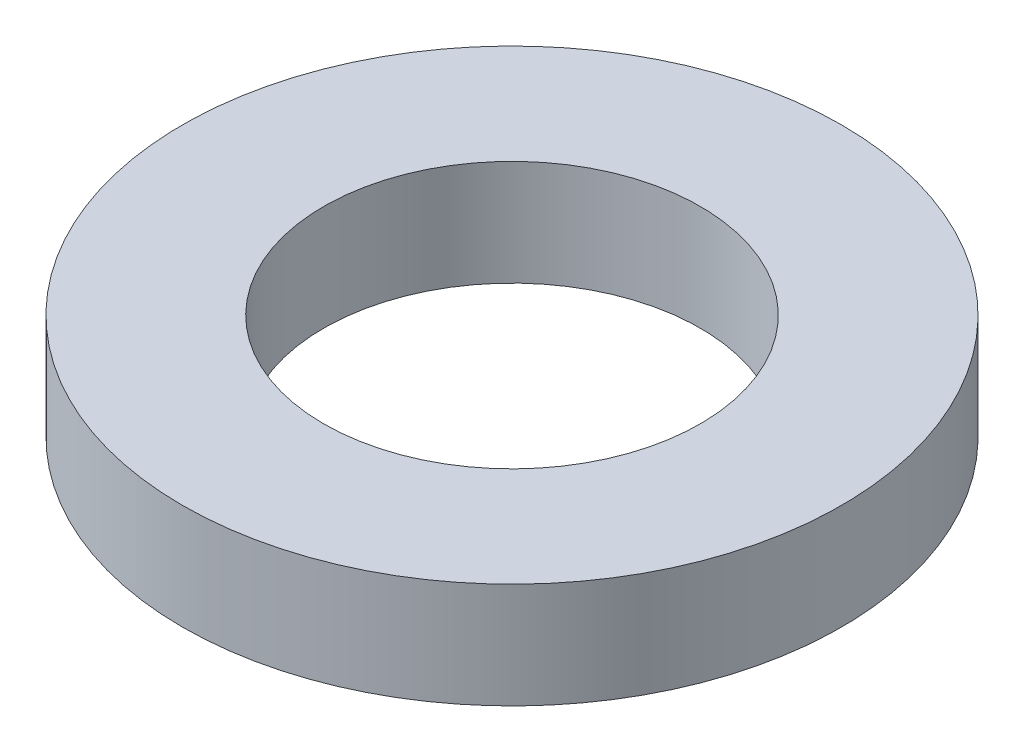
ISO-10303-21;
HEADER;
FILE_DESCRIPTION(('STEP AP214'),'2;1');
FILE_NAME('part.step','',(''),(''),'','','');
FILE_SCHEMA(('AUTOMOTIVE_DESIGN { 1 0 10303 214 1 1 1 1 }'));
ENDSEC;
DATA;
#1=APPLICATION_CONTEXT('core data for automotive mechanical design processes');
#2=APPLICATION_PROTOCOL_DEFINITION('international standard','automotive_design',2000,#1);
#3=PRODUCT_CONTEXT('',#1,'mechanical');
#4=PRODUCT('Part','Part','',(#3));
#5=PRODUCT_RELATED_PRODUCT_CATEGORY('part','',(#4));
#6=PRODUCT_DEFINITION_FORMATION('','',#4);
#7=PRODUCT_DEFINITION_CONTEXT('part definition',#1,'design');
#8=PRODUCT_DEFINITION('design','',#6,#7);
#9=PRODUCT_DEFINITION_SHAPE('','',#8);
#10=(LENGTH_UNIT() NAMED_UNIT(*) SI_UNIT(.MILLI.,.METRE.));
#11=(NAMED_UNIT(*) PLANE_ANGLE_UNIT() SI_UNIT($,.RADIAN.));
#12=(NAMED_UNIT(*) SI_UNIT($,.STERADIAN.) SOLID_ANGLE_UNIT());
#13=UNCERTAINTY_MEASURE_WITH_UNIT(LENGTH_MEASURE(1.E-05),#10,'distance_accuracy_value','');
#14=(GEOMETRIC_REPRESENTATION_CONTEXT(3) GLOBAL_UNCERTAINTY_ASSIGNED_CONTEXT((#13)) GLOBAL_UNIT_ASSIGNED_CONTEXT((#10,
#11,#12)) REPRESENTATION_CONTEXT('',''));
#15=CARTESIAN_POINT('',(0.,0.,0.));
#16=DIRECTION('',(0.,0.,1.));
#17=DIRECTION('',(1.,0.,0.));
#18=AXIS2_PLACEMENT_3D('',#15,#16,#17);
#19=CARTESIAN_POINT('',(0.,28.,0.));
#20=DIRECTION('',(0.,-1.,0.));
#21=DIRECTION('',(0.,0.,-1.));
#22=AXIS2_PLACEMENT_3D('',#19,#20,#21);
#23=CYLINDRICAL_SURFACE('',#22,87.5);
#24=CARTESIAN_POINT('',(0.,28.,0.));
#25=DIRECTION('',(0.,1.,0.));
#26=DIRECTION('',(0.,0.,1.));
#27=AXIS2_PLACEMENT_3D('',#24,#25,#26);
#28=CIRCLE('',#27,87.5);
#29=CARTESIAN_POINT('',(0.,28.,87.5));
#30=VERTEX_POINT('',#29);
#31=EDGE_CURVE('E10',#30,#30,#28,.T.);
#32=ORIENTED_EDGE('',*,*,#31,.F.);
#33=EDGE_LOOP('',(#32));
#34=FACE_BOUND('',#33,.T.);
#35=CARTESIAN_POINT('',(0.,0.,0.));
#36=DIRECTION('',(0.,1.,0.));
#37=DIRECTION('',(0.,0.,1.));
#38=AXIS2_PLACEMENT_3D('',#35,#36,#37);
#39=CIRCLE('',#38,87.5);
#40=CARTESIAN_POINT('',(0.,0.,87.5));
#41=VERTEX_POINT('',#40);
#42=EDGE_CURVE('E37',#41,#41,#39,.T.);
#43=ORIENTED_EDGE('',*,*,#42,.T.);
#44=EDGE_LOOP('',(#43));
#45=FACE_BOUND('',#44,.T.);
#46=ADVANCED_FACE('F40',(#34,#45),#23,.T.);
#47=CARTESIAN_POINT('',(0.,28.,0.));
#48=DIRECTION('',(0.,1.,0.));
#49=DIRECTION('',(0.,0.,1.));
#50=AXIS2_PLACEMENT_3D('',#47,#48,#49);
#51=PLANE('',#50);
#52=CARTESIAN_POINT('',(0.,28.,0.));
#53=DIRECTION('',(0.,1.,0.));
#54=DIRECTION('',(0.,0.,1.));
#55=AXIS2_PLACEMENT_3D('',#52,#53,#54);
#56=CIRCLE('',#55,50.);
#57=CARTESIAN_POINT('',(0.,28.,50.));
#58=VERTEX_POINT('',#57);
#59=EDGE_CURVE('E50',#58,#58,#56,.T.);
#60=ORIENTED_EDGE('',*,*,#59,.F.);
#61=EDGE_LOOP('',(#60));
#62=FACE_BOUND('',#61,.T.);
#63=ORIENTED_EDGE('',*,*,#31,.T.);
#64=EDGE_LOOP('',(#63));
#65=FACE_BOUND('',#64,.T.);
#66=ADVANCED_FACE('F59',(#62,#65),#51,.T.);
#67=CARTESIAN_POINT('',(0.,0.,0.));
#68=DIRECTION('',(0.,1.,0.));
#69=DIRECTION('',(0.,0.,1.));
#70=AXIS2_PLACEMENT_3D('',#67,#68,#69);
#71=PLANE('',#70);
#72=CARTESIAN_POINT('',(0.,0.,0.));
#73=DIRECTION('',(0.,1.,0.));
#74=DIRECTION('',(0.,0.,1.));
#75=AXIS2_PLACEMENT_3D('',#72,#73,#74);
#76=CIRCLE('',#75,50.);
#77=CARTESIAN_POINT('',(0.,0.,50.));
#78=VERTEX_POINT('',#77);
#79=EDGE_CURVE('E47',#78,#78,#76,.T.);
#80=ORIENTED_EDGE('',*,*,#79,.T.);
#81=EDGE_LOOP('',(#80));
#82=FACE_BOUND('',#81,.T.);
#83=ORIENTED_EDGE('',*,*,#42,.F.);
#84=EDGE_LOOP('',(#83));
#85=FACE_BOUND('',#84,.T.);
#86=ADVANCED_FACE('F58',(#82,#85),#71,.F.);
#87=CARTESIAN_POINT('',(0.,28.,0.));
#88=DIRECTION('',(0.,-1.,0.));
#89=DIRECTION('',(0.,0.,-1.));
#90=AXIS2_PLACEMENT_3D('',#87,#88,#89);
#91=CYLINDRICAL_SURFACE('',#90,50.);
#92=ORIENTED_EDGE('',*,*,#59,.T.);
#93=EDGE_LOOP('',(#92));
#94=FACE_BOUND('',#93,.T.);
#95=ORIENTED_EDGE('',*,*,#79,.F.);
#96=EDGE_LOOP('',(#95));
#97=FACE_BOUND('',#96,.T.);
#98=ADVANCED_FACE('F54',(#94,#97),#91,.F.);
#99=CLOSED_SHELL('',(#46,#66,#86,#98));
#100=MANIFOLD_SOLID_BREP('B2',#99);
#101=ADVANCED_BREP_SHAPE_REPRESENTATION('',(#18,#100),#14);
#102=SHAPE_DEFINITION_REPRESENTATION(#9,#101);
ENDSEC;
END-ISO-10303-21;
